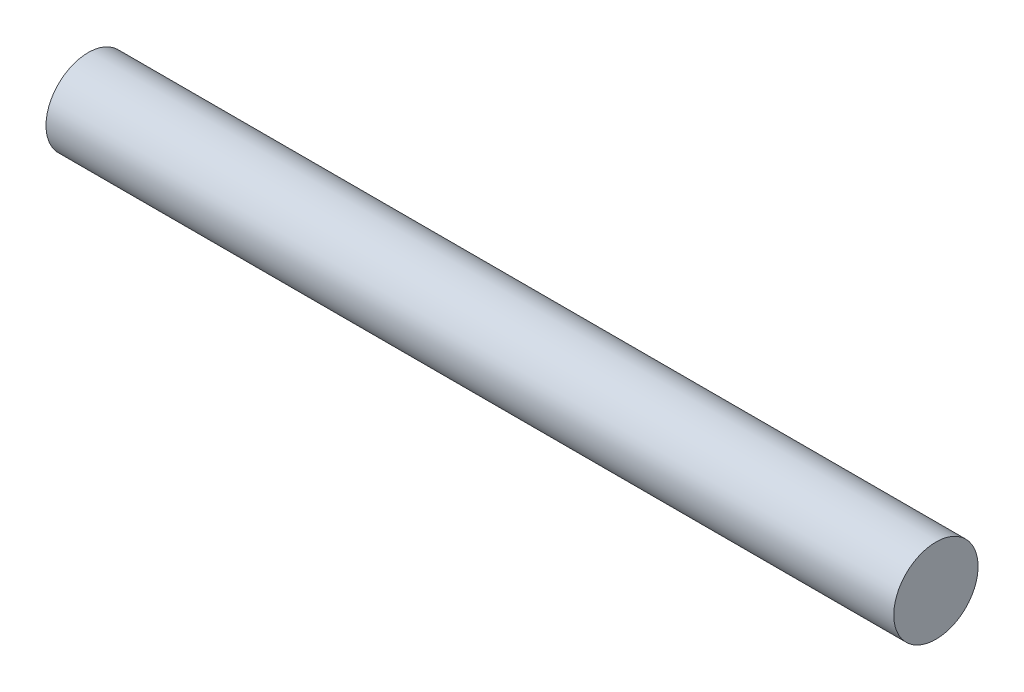
ISO-10303-21;
HEADER;
FILE_DESCRIPTION(('STEP AP214'),'2;1');
FILE_NAME('part.step','',(''),(''),'','','');
FILE_SCHEMA(('AUTOMOTIVE_DESIGN { 1 0 10303 214 1 1 1 1 }'));
ENDSEC;
DATA;
#1=APPLICATION_CONTEXT('core data for automotive mechanical design processes');
#2=APPLICATION_PROTOCOL_DEFINITION('international standard','automotive_design',2000,#1);
#3=PRODUCT_CONTEXT('',#1,'mechanical');
#4=PRODUCT('Part','Part','',(#3));
#5=PRODUCT_RELATED_PRODUCT_CATEGORY('part','',(#4));
#6=PRODUCT_DEFINITION_FORMATION('','',#4);
#7=PRODUCT_DEFINITION_CONTEXT('part definition',#1,'design');
#8=PRODUCT_DEFINITION('design','',#6,#7);
#9=PRODUCT_DEFINITION_SHAPE('','',#8);
#10=(LENGTH_UNIT() NAMED_UNIT(*) SI_UNIT(.MILLI.,.METRE.));
#11=(NAMED_UNIT(*) PLANE_ANGLE_UNIT() SI_UNIT($,.RADIAN.));
#12=(NAMED_UNIT(*) SI_UNIT($,.STERADIAN.) SOLID_ANGLE_UNIT());
#13=UNCERTAINTY_MEASURE_WITH_UNIT(LENGTH_MEASURE(1.E-05),#10,'distance_accuracy_value','');
#14=(GEOMETRIC_REPRESENTATION_CONTEXT(3) GLOBAL_UNCERTAINTY_ASSIGNED_CONTEXT((#13)) GLOBAL_UNIT_ASSIGNED_CONTEXT((#10,
#11,#12)) REPRESENTATION_CONTEXT('',''));
#15=CARTESIAN_POINT('',(0.,0.,0.));
#16=DIRECTION('',(0.,0.,1.));
#17=DIRECTION('',(1.,0.,0.));
#18=AXIS2_PLACEMENT_3D('',#15,#16,#17);
#19=CARTESIAN_POINT('',(15.08125,0.,0.));
#20=DIRECTION('',(1.,0.,0.));
#21=DIRECTION('',(0.,0.,-1.));
#22=AXIS2_PLACEMENT_3D('',#19,#20,#21);
#23=PLANE('',#22);
#24=CARTESIAN_POINT('',(15.08125,0.,0.));
#25=DIRECTION('',(-1.,0.,0.));
#26=DIRECTION('',(0.,0.,1.));
#27=AXIS2_PLACEMENT_3D('',#24,#25,#26);
#28=CIRCLE('',#27,1.5);
#29=CARTESIAN_POINT('',(15.08125,0.,1.5));
#30=VERTEX_POINT('',#29);
#31=EDGE_CURVE('E18',#30,#30,#28,.T.);
#32=ORIENTED_EDGE('',*,*,#31,.F.);
#33=EDGE_LOOP('',(#32));
#34=FACE_BOUND('',#33,.T.);
#35=ADVANCED_FACE('F15',(#34),#23,.T.);
#36=CARTESIAN_POINT('',(-15.08125,0.,0.));
#37=DIRECTION('',(1.,0.,0.));
#38=DIRECTION('',(0.,0.,-1.));
#39=AXIS2_PLACEMENT_3D('',#36,#37,#38);
#40=PLANE('',#39);
#41=CARTESIAN_POINT('',(-15.08125,0.,0.));
#42=DIRECTION('',(-1.,0.,0.));
#43=DIRECTION('',(0.,0.,1.));
#44=AXIS2_PLACEMENT_3D('',#41,#42,#43);
#45=CIRCLE('',#44,1.5);
#46=CARTESIAN_POINT('',(-15.08125,0.,1.5));
#47=VERTEX_POINT('',#46);
#48=EDGE_CURVE('E10',#47,#47,#45,.F.);
#49=ORIENTED_EDGE('',*,*,#48,.F.);
#50=EDGE_LOOP('',(#49));
#51=FACE_BOUND('',#50,.T.);
#52=ADVANCED_FACE('F30',(#51),#40,.F.);
#53=CARTESIAN_POINT('',(15.08125,0.,0.));
#54=DIRECTION('',(-1.,0.,0.));
#55=DIRECTION('',(0.,0.,1.));
#56=AXIS2_PLACEMENT_3D('',#53,#54,#55);
#57=CYLINDRICAL_SURFACE('',#56,1.5);
#58=ORIENTED_EDGE('',*,*,#48,.T.);
#59=EDGE_LOOP('',(#58));
#60=FACE_BOUND('',#59,.T.);
#61=ORIENTED_EDGE('',*,*,#31,.T.);
#62=EDGE_LOOP('',(#61));
#63=FACE_BOUND('',#62,.T.);
#64=ADVANCED_FACE('F27',(#60,#63),#57,.T.);
#65=CLOSED_SHELL('',(#35,#52,#64));
#66=MANIFOLD_SOLID_BREP('B1',#65);
#67=ADVANCED_BREP_SHAPE_REPRESENTATION('',(#18,#66),#14);
#68=SHAPE_DEFINITION_REPRESENTATION(#9,#67);
ENDSEC;
END-ISO-10303-21;
